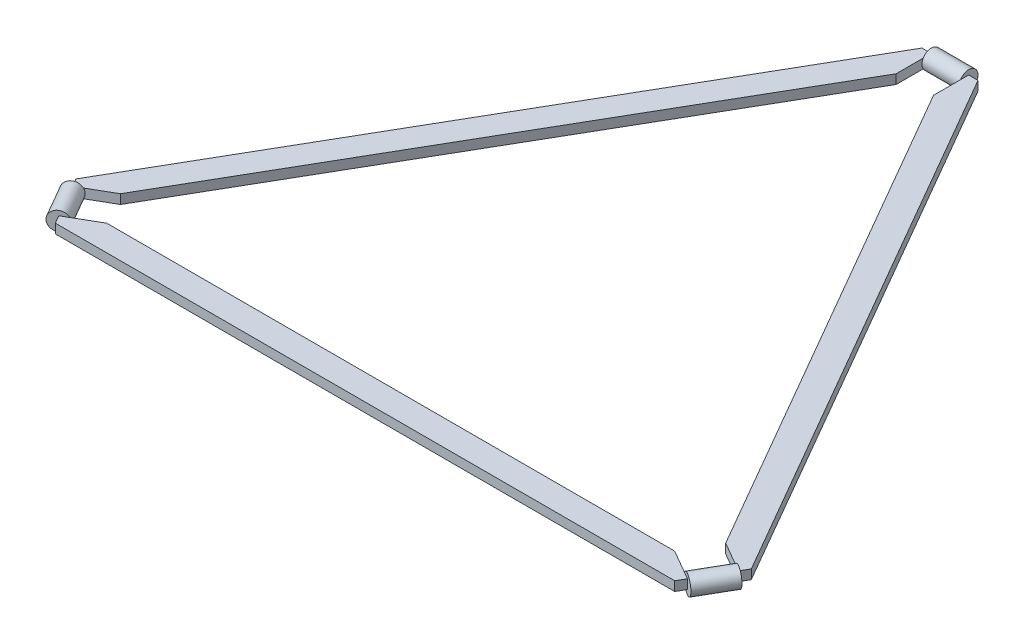
ISO-10303-21;
HEADER;
FILE_DESCRIPTION(('STEP AP214'),'2;1');
FILE_NAME('part.step','',(''),(''),'','','');
FILE_SCHEMA(('AUTOMOTIVE_DESIGN { 1 0 10303 214 1 1 1 1 }'));
ENDSEC;
DATA;
#1=APPLICATION_CONTEXT('core data for automotive mechanical design processes');
#2=APPLICATION_PROTOCOL_DEFINITION('international standard','automotive_design',2000,#1);
#3=PRODUCT_CONTEXT('',#1,'mechanical');
#4=PRODUCT('Part','Part','',(#3));
#5=PRODUCT_RELATED_PRODUCT_CATEGORY('part','',(#4));
#6=PRODUCT_DEFINITION_FORMATION('','',#4);
#7=PRODUCT_DEFINITION_CONTEXT('part definition',#1,'design');
#8=PRODUCT_DEFINITION('design','',#6,#7);
#9=PRODUCT_DEFINITION_SHAPE('','',#8);
#10=(LENGTH_UNIT() NAMED_UNIT(*) SI_UNIT(.MILLI.,.METRE.));
#11=(NAMED_UNIT(*) PLANE_ANGLE_UNIT() SI_UNIT($,.RADIAN.));
#12=(NAMED_UNIT(*) SI_UNIT($,.STERADIAN.) SOLID_ANGLE_UNIT());
#13=UNCERTAINTY_MEASURE_WITH_UNIT(LENGTH_MEASURE(1.E-05),#10,'distance_accuracy_value','');
#14=(GEOMETRIC_REPRESENTATION_CONTEXT(3) GLOBAL_UNCERTAINTY_ASSIGNED_CONTEXT((#13)) GLOBAL_UNIT_ASSIGNED_CONTEXT((#10,
#11,#12)) REPRESENTATION_CONTEXT('',''));
#15=CARTESIAN_POINT('',(0.,0.,0.));
#16=DIRECTION('',(0.,0.,1.));
#17=DIRECTION('',(1.,0.,0.));
#18=AXIS2_PLACEMENT_3D('',#15,#16,#17);
#19=CARTESIAN_POINT('',(-356.410161513775,0.,182.679491924312));
#20=DIRECTION('',(0.5,0.,0.866025403784438));
#21=DIRECTION('',(0.866025403784439,0.,-0.5));
#22=AXIS2_PLACEMENT_3D('',#19,#20,#21);
#23=PLANE('',#22);
#24=DIRECTION('',(-0.866025403784438,0.,0.5));
#25=VECTOR('',#24,1.);
#26=CARTESIAN_POINT('',(-9.99999999999995,-5.,-17.3205080756887));
#27=LINE('',#26,#25);
#28=CARTESIAN_POINT('',(-348.910161513775,-5.,178.349364905389));
#29=VERTEX_POINT('',#28);
#30=CARTESIAN_POINT('',(-356.410161513775,-5.,182.679491924311));
#31=VERTEX_POINT('',#30);
#32=EDGE_CURVE('E53',#29,#31,#27,.T.);
#33=ORIENTED_EDGE('',*,*,#32,.F.);
#34=CARTESIAN_POINT('',(-356.410161513775,0.,182.679491924312));
#35=DIRECTION('',(0.5,0.,0.866025403784438));
#36=DIRECTION('',(0.866025403784439,0.,-0.5));
#37=AXIS2_PLACEMENT_3D('',#34,#35,#36);
#38=CIRCLE('',#37,9.99999999999998);
#39=CARTESIAN_POINT('',(-348.910161513775,5.,178.349364905389));
#40=VERTEX_POINT('',#39);
#41=EDGE_CURVE('E377',#40,#29,#38,.T.);
#42=ORIENTED_EDGE('',*,*,#41,.F.);
#43=DIRECTION('',(-0.866025403784438,0.,0.5));
#44=VECTOR('',#43,1.);
#45=CARTESIAN_POINT('',(-9.99999999999995,5.,-17.3205080756887));
#46=LINE('',#45,#44);
#47=CARTESIAN_POINT('',(-356.410161513775,5.,182.679491924311));
#48=VERTEX_POINT('',#47);
#49=EDGE_CURVE('E316',#40,#48,#46,.T.);
#50=ORIENTED_EDGE('',*,*,#49,.T.);
#51=DIRECTION('',(0.,-1.,0.));
#52=VECTOR('',#51,1.);
#53=CARTESIAN_POINT('',(-356.410161513775,5.,182.679491924311));
#54=LINE('',#53,#52);
#55=EDGE_CURVE('E336',#48,#31,#54,.T.);
#56=ORIENTED_EDGE('',*,*,#55,.T.);
#57=EDGE_LOOP('',(#33,#42,#50,#56));
#58=FACE_BOUND('',#57,.T.);
#59=ADVANCED_FACE('F43',(#58),#23,.F.);
#60=CARTESIAN_POINT('',(-9.99999999999993,5.,17.3205080756886));
#61=DIRECTION('',(0.5,0.,-0.866025403784439));
#62=DIRECTION('',(-0.866025403784439,0.,-0.5));
#63=AXIS2_PLACEMENT_3D('',#60,#61,#62);
#64=PLANE('',#63);
#65=CARTESIAN_POINT('',(336.410161513776,0.,217.320508075689));
#66=DIRECTION('',(0.5,0.,-0.866025403784439));
#67=DIRECTION('',(-0.866025403784439,0.,-0.5));
#68=AXIS2_PLACEMENT_3D('',#65,#66,#67);
#69=CIRCLE('',#68,9.99999999999999);
#70=CARTESIAN_POINT('',(328.910161513776,-5.,212.990381056767));
#71=VERTEX_POINT('',#70);
#72=CARTESIAN_POINT('',(328.910161513776,4.99999999999999,212.990381056767));
#73=VERTEX_POINT('',#72);
#74=EDGE_CURVE('E11',#71,#73,#69,.T.);
#75=ORIENTED_EDGE('',*,*,#74,.F.);
#76=DIRECTION('',(0.866025403784439,0.,0.5));
#77=VECTOR('',#76,1.);
#78=CARTESIAN_POINT('',(-9.99999999999993,-5.,17.3205080756886));
#79=LINE('',#78,#77);
#80=CARTESIAN_POINT('',(303.846502664651,-5.,198.519870873347));
#81=VERTEX_POINT('',#80);
#82=EDGE_CURVE('E414',#81,#71,#79,.T.);
#83=ORIENTED_EDGE('',*,*,#82,.F.);
#84=DIRECTION('',(0.,-1.,0.));
#85=VECTOR('',#84,1.);
#86=CARTESIAN_POINT('',(303.846502664651,5.,198.519870873347));
#87=LINE('',#86,#85);
#88=CARTESIAN_POINT('',(303.846502664651,5.,198.519870873347));
#89=VERTEX_POINT('',#88);
#90=EDGE_CURVE('E47',#89,#81,#87,.T.);
#91=ORIENTED_EDGE('',*,*,#90,.F.);
#92=DIRECTION('',(0.866025403784439,0.,0.5));
#93=VECTOR('',#92,1.);
#94=CARTESIAN_POINT('',(-9.99999999999993,5.,17.3205080756886));
#95=LINE('',#94,#93);
#96=EDGE_CURVE('E388',#89,#73,#95,.T.);
#97=ORIENTED_EDGE('',*,*,#96,.T.);
#98=EDGE_LOOP('',(#75,#83,#91,#97));
#99=FACE_BOUND('',#98,.T.);
#100=ADVANCED_FACE('F45',(#99),#64,.T.);
#101=CARTESIAN_POINT('',(0.,5.,198.519870873347));
#102=DIRECTION('',(0.,0.,-1.));
#103=DIRECTION('',(-1.,0.,0.));
#104=AXIS2_PLACEMENT_3D('',#101,#102,#103);
#105=PLANE('',#104);
#106=DIRECTION('',(1.,0.,0.));
#107=VECTOR('',#106,1.);
#108=CARTESIAN_POINT('',(0.,-5.,198.519870873347));
#109=LINE('',#108,#107);
#110=CARTESIAN_POINT('',(-303.84650266465,-5.,198.519870873348));
#111=VERTEX_POINT('',#110);
#112=EDGE_CURVE('E417',#111,#81,#109,.T.);
#113=ORIENTED_EDGE('',*,*,#112,.F.);
#114=DIRECTION('',(0.,-1.,0.));
#115=VECTOR('',#114,1.);
#116=CARTESIAN_POINT('',(-303.84650266465,5.,198.519870873348));
#117=LINE('',#116,#115);
#118=CARTESIAN_POINT('',(-303.84650266465,5.,198.519870873348));
#119=VERTEX_POINT('',#118);
#120=EDGE_CURVE('E448',#119,#111,#117,.T.);
#121=ORIENTED_EDGE('',*,*,#120,.F.);
#122=DIRECTION('',(1.,0.,0.));
#123=VECTOR('',#122,1.);
#124=CARTESIAN_POINT('',(0.,5.,198.519870873347));
#125=LINE('',#124,#123);
#126=EDGE_CURVE('E391',#119,#89,#125,.T.);
#127=ORIENTED_EDGE('',*,*,#126,.T.);
#128=ORIENTED_EDGE('',*,*,#90,.T.);
#129=EDGE_LOOP('',(#113,#121,#127,#128));
#130=FACE_BOUND('',#129,.T.);
#131=ADVANCED_FACE('F525',(#130),#105,.T.);
#132=CARTESIAN_POINT('',(10.0000000000002,5.,17.3205080756892));
#133=DIRECTION('',(-0.5,0.,-0.866025403784439));
#134=DIRECTION('',(-0.866025403784439,0.,0.5));
#135=AXIS2_PLACEMENT_3D('',#132,#133,#134);
#136=PLANE('',#135);
#137=CARTESIAN_POINT('',(-336.410161513775,0.,217.320508075689));
#138=DIRECTION('',(-0.5,0.,-0.866025403784439));
#139=DIRECTION('',(-0.866025403784439,0.,0.5));
#140=AXIS2_PLACEMENT_3D('',#137,#138,#139);
#141=CIRCLE('',#140,9.99999999999998);
#142=CARTESIAN_POINT('',(-328.910161513775,5.,212.990381056767));
#143=VERTEX_POINT('',#142);
#144=CARTESIAN_POINT('',(-328.910161513775,-4.99999999999999,212.990381056767));
#145=VERTEX_POINT('',#144);
#146=EDGE_CURVE('E383',#143,#145,#141,.T.);
#147=ORIENTED_EDGE('',*,*,#146,.F.);
#148=DIRECTION('',(0.866025403784439,0.,-0.5));
#149=VECTOR('',#148,1.);
#150=CARTESIAN_POINT('',(10.0000000000002,5.,17.3205080756892));
#151=LINE('',#150,#149);
#152=EDGE_CURVE('E396',#143,#119,#151,.T.);
#153=ORIENTED_EDGE('',*,*,#152,.T.);
#154=ORIENTED_EDGE('',*,*,#120,.T.);
#155=DIRECTION('',(0.866025403784439,0.,-0.5));
#156=VECTOR('',#155,1.);
#157=CARTESIAN_POINT('',(10.0000000000002,-5.,17.3205080756892));
#158=LINE('',#157,#156);
#159=EDGE_CURVE('E421',#145,#111,#158,.T.);
#160=ORIENTED_EDGE('',*,*,#159,.F.);
#161=EDGE_LOOP('',(#147,#153,#154,#160));
#162=FACE_BOUND('',#161,.T.);
#163=ADVANCED_FACE('F551',(#162),#136,.T.);
#164=CARTESIAN_POINT('',(-346.410161513775,5.,200.));
#165=DIRECTION('',(-0.866025403784438,0.,0.500000000000001));
#166=DIRECTION('',(0.500000000000001,0.,0.866025403784438));
#167=AXIS2_PLACEMENT_3D('',#164,#165,#166);
#168=PLANE('',#167);
#169=DIRECTION('',(-0.500000000000001,0.,-0.866025403784438));
#170=VECTOR('',#169,1.);
#171=CARTESIAN_POINT('',(-346.410161513775,-5.,200.));
#172=LINE('',#171,#170);
#173=CARTESIAN_POINT('',(-331.410161513775,-5.,225.980762113533));
#174=VERTEX_POINT('',#173);
#175=CARTESIAN_POINT('',(-336.410161513775,-5.,217.320508075689));
#176=VERTEX_POINT('',#175);
#177=EDGE_CURVE('E425',#174,#176,#172,.T.);
#178=ORIENTED_EDGE('',*,*,#177,.F.);
#179=DIRECTION('',(0.,-1.,0.));
#180=VECTOR('',#179,1.);
#181=CARTESIAN_POINT('',(-331.410161513775,5.,225.980762113533));
#182=LINE('',#181,#180);
#183=CARTESIAN_POINT('',(-331.410161513775,5.,225.980762113533));
#184=VERTEX_POINT('',#183);
#185=EDGE_CURVE('E443',#184,#174,#182,.T.);
#186=ORIENTED_EDGE('',*,*,#185,.F.);
#187=DIRECTION('',(-0.500000000000001,0.,-0.866025403784438));
#188=VECTOR('',#187,1.);
#189=CARTESIAN_POINT('',(-346.410161513775,5.,200.));
#190=LINE('',#189,#188);
#191=CARTESIAN_POINT('',(-336.410161513775,5.,217.320508075689));
#192=VERTEX_POINT('',#191);
#193=EDGE_CURVE('E401',#184,#192,#190,.T.);
#194=ORIENTED_EDGE('',*,*,#193,.T.);
#195=DIRECTION('',(0.,-1.,0.));
#196=VECTOR('',#195,1.);
#197=CARTESIAN_POINT('',(-336.410161513775,5.,217.320508075689));
#198=LINE('',#197,#196);
#199=EDGE_CURVE('E446',#192,#176,#198,.T.);
#200=ORIENTED_EDGE('',*,*,#199,.T.);
#201=EDGE_LOOP('',(#178,#186,#194,#200));
#202=FACE_BOUND('',#201,.T.);
#203=ADVANCED_FACE('F547',(#202),#168,.T.);
#204=CARTESIAN_POINT('',(0.,5.,225.980762113533));
#205=DIRECTION('',(0.,0.,1.));
#206=DIRECTION('',(1.,0.,0.));
#207=AXIS2_PLACEMENT_3D('',#204,#205,#206);
#208=PLANE('',#207);
#209=DIRECTION('',(-1.,0.,0.));
#210=VECTOR('',#209,1.);
#211=CARTESIAN_POINT('',(0.,-5.,225.980762113533));
#212=LINE('',#211,#210);
#213=CARTESIAN_POINT('',(331.410161513776,-5.,225.980762113533));
#214=VERTEX_POINT('',#213);
#215=EDGE_CURVE('E429',#214,#174,#212,.T.);
#216=ORIENTED_EDGE('',*,*,#215,.F.);
#217=DIRECTION('',(0.,-1.,0.));
#218=VECTOR('',#217,1.);
#219=CARTESIAN_POINT('',(331.410161513776,5.,225.980762113533));
#220=LINE('',#219,#218);
#221=CARTESIAN_POINT('',(331.410161513776,5.,225.980762113533));
#222=VERTEX_POINT('',#221);
#223=EDGE_CURVE('E440',#222,#214,#220,.T.);
#224=ORIENTED_EDGE('',*,*,#223,.F.);
#225=DIRECTION('',(-1.,0.,0.));
#226=VECTOR('',#225,1.);
#227=CARTESIAN_POINT('',(0.,5.,225.980762113533));
#228=LINE('',#227,#226);
#229=EDGE_CURVE('E405',#222,#184,#228,.T.);
#230=ORIENTED_EDGE('',*,*,#229,.T.);
#231=ORIENTED_EDGE('',*,*,#185,.T.);
#232=EDGE_LOOP('',(#216,#224,#230,#231));
#233=FACE_BOUND('',#232,.T.);
#234=ADVANCED_FACE('F543',(#233),#208,.T.);
#235=CARTESIAN_POINT('',(346.410161513776,5.,200.));
#236=DIRECTION('',(0.866025403784439,0.,0.499999999999999));
#237=DIRECTION('',(0.499999999999999,0.,-0.866025403784439));
#238=AXIS2_PLACEMENT_3D('',#235,#236,#237);
#239=PLANE('',#238);
#240=DIRECTION('',(-0.499999999999999,0.,0.866025403784439));
#241=VECTOR('',#240,1.);
#242=CARTESIAN_POINT('',(346.410161513776,-5.,200.));
#243=LINE('',#242,#241);
#244=CARTESIAN_POINT('',(336.410161513776,-5.,217.320508075689));
#245=VERTEX_POINT('',#244);
#246=EDGE_CURVE('E433',#245,#214,#243,.T.);
#247=ORIENTED_EDGE('',*,*,#246,.F.);
#248=DIRECTION('',(0.,-1.,0.));
#249=VECTOR('',#248,1.);
#250=CARTESIAN_POINT('',(336.410161513776,5.,217.320508075689));
#251=LINE('',#250,#249);
#252=CARTESIAN_POINT('',(336.410161513776,5.,217.320508075689));
#253=VERTEX_POINT('',#252);
#254=EDGE_CURVE('E413',#253,#245,#251,.T.);
#255=ORIENTED_EDGE('',*,*,#254,.F.);
#256=DIRECTION('',(-0.499999999999999,0.,0.866025403784439));
#257=VECTOR('',#256,1.);
#258=CARTESIAN_POINT('',(346.410161513776,5.,200.));
#259=LINE('',#258,#257);
#260=EDGE_CURVE('E409',#253,#222,#259,.T.);
#261=ORIENTED_EDGE('',*,*,#260,.T.);
#262=ORIENTED_EDGE('',*,*,#223,.T.);
#263=EDGE_LOOP('',(#247,#255,#261,#262));
#264=FACE_BOUND('',#263,.T.);
#265=ADVANCED_FACE('F537',(#264),#239,.T.);
#266=CARTESIAN_POINT('',(0.,5.,0.));
#267=DIRECTION('',(0.,1.,0.));
#268=DIRECTION('',(0.,0.,1.));
#269=AXIS2_PLACEMENT_3D('',#266,#267,#268);
#270=PLANE('',#269);
#271=ORIENTED_EDGE('',*,*,#96,.F.);
#272=ORIENTED_EDGE('',*,*,#126,.F.);
#273=ORIENTED_EDGE('',*,*,#152,.F.);
#274=EDGE_CURVE('E397',#192,#143,#151,.T.);
#275=ORIENTED_EDGE('',*,*,#274,.F.);
#276=ORIENTED_EDGE('',*,*,#193,.F.);
#277=ORIENTED_EDGE('',*,*,#229,.F.);
#278=ORIENTED_EDGE('',*,*,#260,.F.);
#279=EDGE_CURVE('E392',#73,#253,#95,.T.);
#280=ORIENTED_EDGE('',*,*,#279,.F.);
#281=EDGE_LOOP('',(#271,#272,#273,#275,#276,#277,#278,#280));
#282=FACE_BOUND('',#281,.T.);
#283=ADVANCED_FACE('F507',(#282),#270,.T.);
#284=CARTESIAN_POINT('',(0.,-5.,0.));
#285=DIRECTION('',(0.,1.,0.));
#286=DIRECTION('',(0.,0.,1.));
#287=AXIS2_PLACEMENT_3D('',#284,#285,#286);
#288=PLANE('',#287);
#289=ORIENTED_EDGE('',*,*,#82,.T.);
#290=EDGE_CURVE('E387',#71,#245,#79,.T.);
#291=ORIENTED_EDGE('',*,*,#290,.T.);
#292=ORIENTED_EDGE('',*,*,#246,.T.);
#293=ORIENTED_EDGE('',*,*,#215,.T.);
#294=ORIENTED_EDGE('',*,*,#177,.T.);
#295=EDGE_CURVE('E422',#176,#145,#158,.T.);
#296=ORIENTED_EDGE('',*,*,#295,.T.);
#297=ORIENTED_EDGE('',*,*,#159,.T.);
#298=ORIENTED_EDGE('',*,*,#112,.T.);
#299=EDGE_LOOP('',(#289,#291,#292,#293,#294,#296,#297,#298));
#300=FACE_BOUND('',#299,.T.);
#301=ADVANCED_FACE('F533',(#300),#288,.F.);
#302=CARTESIAN_POINT('',(-322.268025890044,0.,241.815405503521));
#303=DIRECTION('',(-0.5,0.,-0.866025403784438));
#304=DIRECTION('',(-0.866025403784439,0.,0.5));
#305=AXIS2_PLACEMENT_3D('',#302,#303,#304);
#306=CYLINDRICAL_SURFACE('',#305,9.99999999999998);
#307=ORIENTED_EDGE('',*,*,#146,.T.);
#308=EDGE_CURVE('E381',#145,#143,#141,.T.);
#309=ORIENTED_EDGE('',*,*,#308,.T.);
#310=EDGE_LOOP('',(#307,#309));
#311=FACE_BOUND('',#310,.T.);
#312=ORIENTED_EDGE('',*,*,#41,.T.);
#313=EDGE_CURVE('E382',#29,#40,#38,.T.);
#314=ORIENTED_EDGE('',*,*,#313,.T.);
#315=EDGE_LOOP('',(#312,#314));
#316=FACE_BOUND('',#315,.T.);
#317=ADVANCED_FACE('F530',(#311,#316),#306,.T.);
#318=CARTESIAN_POINT('',(10.0000000000002,5.,17.3205080756892));
#319=DIRECTION('',(-0.5,0.,-0.866025403784439));
#320=DIRECTION('',(-0.866025403784439,0.,0.5));
#321=AXIS2_PLACEMENT_3D('',#318,#319,#320);
#322=PLANE('',#321);
#323=ORIENTED_EDGE('',*,*,#295,.F.);
#324=ORIENTED_EDGE('',*,*,#199,.F.);
#325=ORIENTED_EDGE('',*,*,#274,.T.);
#326=ORIENTED_EDGE('',*,*,#308,.F.);
#327=EDGE_LOOP('',(#323,#324,#325,#326));
#328=FACE_BOUND('',#327,.T.);
#329=ADVANCED_FACE('F528',(#328),#322,.F.);
#330=CARTESIAN_POINT('',(-9.99999999999995,5.,-17.3205080756887));
#331=DIRECTION('',(0.5,0.,0.866025403784438));
#332=DIRECTION('',(0.866025403784438,0.,-0.5));
#333=AXIS2_PLACEMENT_3D('',#330,#331,#332);
#334=PLANE('',#333);
#335=ORIENTED_EDGE('',*,*,#313,.F.);
#336=CARTESIAN_POINT('',(-323.84650266465,-5.,163.87885472197));
#337=VERTEX_POINT('',#336);
#338=EDGE_CURVE('E309',#337,#29,#27,.T.);
#339=ORIENTED_EDGE('',*,*,#338,.F.);
#340=DIRECTION('',(0.,-1.,0.));
#341=VECTOR('',#340,1.);
#342=CARTESIAN_POINT('',(-323.84650266465,5.,163.87885472197));
#343=LINE('',#342,#341);
#344=CARTESIAN_POINT('',(-323.84650266465,5.,163.87885472197));
#345=VERTEX_POINT('',#344);
#346=EDGE_CURVE('E374',#345,#337,#343,.T.);
#347=ORIENTED_EDGE('',*,*,#346,.F.);
#348=EDGE_CURVE('E310',#345,#40,#46,.T.);
#349=ORIENTED_EDGE('',*,*,#348,.T.);
#350=EDGE_LOOP('',(#335,#339,#347,#349));
#351=FACE_BOUND('',#350,.T.);
#352=ADVANCED_FACE('F594',(#351),#334,.T.);
#353=CARTESIAN_POINT('',(20.0000000000001,5.,0.));
#354=DIRECTION('',(-1.,0.,0.));
#355=DIRECTION('',(0.,0.,1.));
#356=AXIS2_PLACEMENT_3D('',#353,#354,#355);
#357=PLANE('',#356);
#358=DIRECTION('',(0.,0.,-1.));
#359=VECTOR('',#358,1.);
#360=CARTESIAN_POINT('',(20.0000000000001,-5.,0.));
#361=LINE('',#360,#359);
#362=CARTESIAN_POINT('',(20.,-5.,-391.339745962156));
#363=VERTEX_POINT('',#362);
#364=CARTESIAN_POINT('',(20.,-5.,-400.));
#365=VERTEX_POINT('',#364);
#366=EDGE_CURVE('E270',#363,#365,#361,.T.);
#367=ORIENTED_EDGE('',*,*,#366,.F.);
#368=CARTESIAN_POINT('',(20.,0.,-400.));
#369=DIRECTION('',(-1.,0.,0.));
#370=DIRECTION('',(0.,0.,1.));
#371=AXIS2_PLACEMENT_3D('',#368,#369,#370);
#372=CIRCLE('',#371,9.99999999999998);
#373=CARTESIAN_POINT('',(20.,5.,-391.339745962156));
#374=VERTEX_POINT('',#373);
#375=EDGE_CURVE('E305',#374,#363,#372,.T.);
#376=ORIENTED_EDGE('',*,*,#375,.F.);
#377=DIRECTION('',(0.,0.,-1.));
#378=VECTOR('',#377,1.);
#379=CARTESIAN_POINT('',(20.0000000000001,5.,0.));
#380=LINE('',#379,#378);
#381=CARTESIAN_POINT('',(20.,5.,-400.));
#382=VERTEX_POINT('',#381);
#383=EDGE_CURVE('E250',#374,#382,#380,.T.);
#384=ORIENTED_EDGE('',*,*,#383,.T.);
#385=DIRECTION('',(0.,-1.,0.));
#386=VECTOR('',#385,1.);
#387=CARTESIAN_POINT('',(20.,5.,-400.));
#388=LINE('',#387,#386);
#389=EDGE_CURVE('E267',#382,#365,#388,.T.);
#390=ORIENTED_EDGE('',*,*,#389,.T.);
#391=EDGE_LOOP('',(#367,#376,#384,#390));
#392=FACE_BOUND('',#391,.T.);
#393=ADVANCED_FACE('F592',(#392),#357,.F.);
#394=CARTESIAN_POINT('',(-171.923251332325,5.,-99.2599354366735));
#395=DIRECTION('',(0.866025403784439,0.,0.5));
#396=DIRECTION('',(0.5,0.,-0.866025403784439));
#397=AXIS2_PLACEMENT_3D('',#394,#395,#396);
#398=PLANE('',#397);
#399=DIRECTION('',(-0.5,0.,0.866025403784439));
#400=VECTOR('',#399,1.);
#401=CARTESIAN_POINT('',(-171.923251332325,-5.,-99.2599354366735));
#402=LINE('',#401,#400);
#403=CARTESIAN_POINT('',(-20.,-5.,-362.398725595316));
#404=VERTEX_POINT('',#403);
#405=EDGE_CURVE('E340',#404,#337,#402,.T.);
#406=ORIENTED_EDGE('',*,*,#405,.F.);
#407=DIRECTION('',(0.,-1.,0.));
#408=VECTOR('',#407,1.);
#409=CARTESIAN_POINT('',(-20.,5.,-362.398725595316));
#410=LINE('',#409,#408);
#411=CARTESIAN_POINT('',(-20.,5.,-362.398725595316));
#412=VERTEX_POINT('',#411);
#413=EDGE_CURVE('E370',#412,#404,#410,.T.);
#414=ORIENTED_EDGE('',*,*,#413,.F.);
#415=DIRECTION('',(-0.5,0.,0.866025403784439));
#416=VECTOR('',#415,1.);
#417=CARTESIAN_POINT('',(-171.923251332325,5.,-99.2599354366735));
#418=LINE('',#417,#416);
#419=EDGE_CURVE('E314',#412,#345,#418,.T.);
#420=ORIENTED_EDGE('',*,*,#419,.T.);
#421=ORIENTED_EDGE('',*,*,#346,.T.);
#422=EDGE_LOOP('',(#406,#414,#420,#421));
#423=FACE_BOUND('',#422,.T.);
#424=ADVANCED_FACE('F590',(#423),#398,.T.);
#425=CARTESIAN_POINT('',(-20.,5.,0.));
#426=DIRECTION('',(1.,0.,0.));
#427=DIRECTION('',(0.,0.,-1.));
#428=AXIS2_PLACEMENT_3D('',#425,#426,#427);
#429=PLANE('',#428);
#430=CARTESIAN_POINT('',(-20.,0.,-400.));
#431=DIRECTION('',(1.,0.,0.));
#432=DIRECTION('',(0.,0.,-1.));
#433=AXIS2_PLACEMENT_3D('',#430,#431,#432);
#434=CIRCLE('',#433,9.99999999999998);
#435=CARTESIAN_POINT('',(-20.,5.,-391.339745962156));
#436=VERTEX_POINT('',#435);
#437=CARTESIAN_POINT('',(-20.,-4.99999999999999,-391.339745962156));
#438=VERTEX_POINT('',#437);
#439=EDGE_CURVE('E300',#436,#438,#434,.T.);
#440=ORIENTED_EDGE('',*,*,#439,.F.);
#441=DIRECTION('',(0.,0.,1.));
#442=VECTOR('',#441,1.);
#443=CARTESIAN_POINT('',(-20.,5.,0.));
#444=LINE('',#443,#442);
#445=EDGE_CURVE('E320',#436,#412,#444,.T.);
#446=ORIENTED_EDGE('',*,*,#445,.T.);
#447=ORIENTED_EDGE('',*,*,#413,.T.);
#448=DIRECTION('',(0.,0.,1.));
#449=VECTOR('',#448,1.);
#450=CARTESIAN_POINT('',(-20.,-5.,0.));
#451=LINE('',#450,#449);
#452=EDGE_CURVE('E344',#438,#404,#451,.T.);
#453=ORIENTED_EDGE('',*,*,#452,.F.);
#454=EDGE_LOOP('',(#440,#446,#447,#453));
#455=FACE_BOUND('',#454,.T.);
#456=ADVANCED_FACE('F493',(#455),#429,.T.);
#457=CARTESIAN_POINT('',(0.,5.,-400.));
#458=DIRECTION('',(0.,0.,-1.));
#459=DIRECTION('',(-1.,0.,0.));
#460=AXIS2_PLACEMENT_3D('',#457,#458,#459);
#461=PLANE('',#460);
#462=DIRECTION('',(1.,0.,0.));
#463=VECTOR('',#462,1.);
#464=CARTESIAN_POINT('',(0.,-5.,-400.));
#465=LINE('',#464,#463);
#466=CARTESIAN_POINT('',(-30.,-5.,-400.));
#467=VERTEX_POINT('',#466);
#468=CARTESIAN_POINT('',(-20.,-5.,-400.));
#469=VERTEX_POINT('',#468);
#470=EDGE_CURVE('E348',#467,#469,#465,.T.);
#471=ORIENTED_EDGE('',*,*,#470,.F.);
#472=DIRECTION('',(0.,-1.,0.));
#473=VECTOR('',#472,1.);
#474=CARTESIAN_POINT('',(-30.,5.,-400.));
#475=LINE('',#474,#473);
#476=CARTESIAN_POINT('',(-30.,5.,-400.));
#477=VERTEX_POINT('',#476);
#478=EDGE_CURVE('E365',#477,#467,#475,.T.);
#479=ORIENTED_EDGE('',*,*,#478,.F.);
#480=DIRECTION('',(1.,0.,0.));
#481=VECTOR('',#480,1.);
#482=CARTESIAN_POINT('',(0.,5.,-400.));
#483=LINE('',#482,#481);
#484=CARTESIAN_POINT('',(-20.,5.,-400.));
#485=VERTEX_POINT('',#484);
#486=EDGE_CURVE('E325',#477,#485,#483,.T.);
#487=ORIENTED_EDGE('',*,*,#486,.T.);
#488=DIRECTION('',(0.,-1.,0.));
#489=VECTOR('',#488,1.);
#490=CARTESIAN_POINT('',(-20.,5.,-400.));
#491=LINE('',#490,#489);
#492=EDGE_CURVE('E368',#485,#469,#491,.T.);
#493=ORIENTED_EDGE('',*,*,#492,.T.);
#494=EDGE_LOOP('',(#471,#479,#487,#493));
#495=FACE_BOUND('',#494,.T.);
#496=ADVANCED_FACE('F485',(#495),#461,.T.);
#497=CARTESIAN_POINT('',(-195.705080756888,5.,-112.990381056766));
#498=DIRECTION('',(0.866025403784439,0.,0.5));
#499=DIRECTION('',(0.5,0.,-0.866025403784439));
#500=AXIS2_PLACEMENT_3D('',#497,#498,#499);
#501=PLANE('',#500);
#502=DIRECTION('',(-0.5,0.,0.866025403784439));
#503=VECTOR('',#502,1.);
#504=CARTESIAN_POINT('',(-195.705080756888,-5.,-112.990381056766));
#505=LINE('',#504,#503);
#506=CARTESIAN_POINT('',(-361.410161513775,-5.,174.019237886467));
#507=VERTEX_POINT('',#506);
#508=EDGE_CURVE('E352',#467,#507,#505,.T.);
#509=ORIENTED_EDGE('',*,*,#508,.T.);
#510=DIRECTION('',(0.,-1.,0.));
#511=VECTOR('',#510,1.);
#512=CARTESIAN_POINT('',(-361.410161513775,5.,174.019237886467));
#513=LINE('',#512,#511);
#514=CARTESIAN_POINT('',(-361.410161513775,5.,174.019237886467));
#515=VERTEX_POINT('',#514);
#516=EDGE_CURVE('E362',#515,#507,#513,.T.);
#517=ORIENTED_EDGE('',*,*,#516,.F.);
#518=DIRECTION('',(-0.5,0.,0.866025403784439));
#519=VECTOR('',#518,1.);
#520=CARTESIAN_POINT('',(-195.705080756888,5.,-112.990381056766));
#521=LINE('',#520,#519);
#522=EDGE_CURVE('E329',#477,#515,#521,.T.);
#523=ORIENTED_EDGE('',*,*,#522,.F.);
#524=ORIENTED_EDGE('',*,*,#478,.T.);
#525=EDGE_LOOP('',(#509,#517,#523,#524));
#526=FACE_BOUND('',#525,.T.);
#527=ADVANCED_FACE('F481',(#526),#501,.F.);
#528=CARTESIAN_POINT('',(-346.410161513775,5.,200.));
#529=DIRECTION('',(-0.866025403784438,0.,0.500000000000001));
#530=DIRECTION('',(0.500000000000001,0.,0.866025403784438));
#531=AXIS2_PLACEMENT_3D('',#528,#529,#530);
#532=PLANE('',#531);
#533=DIRECTION('',(-0.500000000000001,0.,-0.866025403784438));
#534=VECTOR('',#533,1.);
#535=CARTESIAN_POINT('',(-346.410161513775,-5.,200.));
#536=LINE('',#535,#534);
#537=EDGE_CURVE('E315',#31,#507,#536,.T.);
#538=ORIENTED_EDGE('',*,*,#537,.F.);
#539=ORIENTED_EDGE('',*,*,#55,.F.);
#540=DIRECTION('',(-0.500000000000001,0.,-0.866025403784438));
#541=VECTOR('',#540,1.);
#542=CARTESIAN_POINT('',(-346.410161513775,5.,200.));
#543=LINE('',#542,#541);
#544=EDGE_CURVE('E332',#48,#515,#543,.T.);
#545=ORIENTED_EDGE('',*,*,#544,.T.);
#546=ORIENTED_EDGE('',*,*,#516,.T.);
#547=EDGE_LOOP('',(#538,#539,#545,#546));
#548=FACE_BOUND('',#547,.T.);
#549=ADVANCED_FACE('F473',(#548),#532,.T.);
#550=CARTESIAN_POINT('',(0.,5.,0.));
#551=DIRECTION('',(0.,1.,0.));
#552=DIRECTION('',(0.,0.,1.));
#553=AXIS2_PLACEMENT_3D('',#550,#551,#552);
#554=PLANE('',#553);
#555=ORIENTED_EDGE('',*,*,#348,.F.);
#556=ORIENTED_EDGE('',*,*,#419,.F.);
#557=ORIENTED_EDGE('',*,*,#445,.F.);
#558=EDGE_CURVE('E321',#485,#436,#444,.T.);
#559=ORIENTED_EDGE('',*,*,#558,.F.);
#560=ORIENTED_EDGE('',*,*,#486,.F.);
#561=ORIENTED_EDGE('',*,*,#522,.T.);
#562=ORIENTED_EDGE('',*,*,#544,.F.);
#563=ORIENTED_EDGE('',*,*,#49,.F.);
#564=EDGE_LOOP('',(#555,#556,#557,#559,#560,#561,#562,#563));
#565=FACE_BOUND('',#564,.T.);
#566=ADVANCED_FACE('F476',(#565),#554,.T.);
#567=CARTESIAN_POINT('',(0.,-5.,0.));
#568=DIRECTION('',(0.,1.,0.));
#569=DIRECTION('',(0.,0.,1.));
#570=AXIS2_PLACEMENT_3D('',#567,#568,#569);
#571=PLANE('',#570);
#572=ORIENTED_EDGE('',*,*,#338,.T.);
#573=ORIENTED_EDGE('',*,*,#32,.T.);
#574=ORIENTED_EDGE('',*,*,#537,.T.);
#575=ORIENTED_EDGE('',*,*,#508,.F.);
#576=ORIENTED_EDGE('',*,*,#470,.T.);
#577=EDGE_CURVE('E345',#469,#438,#451,.T.);
#578=ORIENTED_EDGE('',*,*,#577,.T.);
#579=ORIENTED_EDGE('',*,*,#452,.T.);
#580=ORIENTED_EDGE('',*,*,#405,.T.);
#581=EDGE_LOOP('',(#572,#573,#574,#575,#576,#578,#579,#580));
#582=FACE_BOUND('',#581,.T.);
#583=ADVANCED_FACE('F468',(#582),#571,.F.);
#584=CARTESIAN_POINT('',(-20.,0.,-400.));
#585=DIRECTION('',(1.,0.,0.));
#586=DIRECTION('',(0.,0.,-1.));
#587=AXIS2_PLACEMENT_3D('',#584,#585,#586);
#588=PLANE('',#587);
#589=ORIENTED_EDGE('',*,*,#577,.F.);
#590=ORIENTED_EDGE('',*,*,#492,.F.);
#591=ORIENTED_EDGE('',*,*,#558,.T.);
#592=EDGE_CURVE('E299',#438,#436,#434,.T.);
#593=ORIENTED_EDGE('',*,*,#592,.F.);
#594=EDGE_LOOP('',(#589,#590,#591,#593));
#595=FACE_BOUND('',#594,.T.);
#596=ADVANCED_FACE('F488',(#595),#588,.F.);
#597=CARTESIAN_POINT('',(48.2842712474619,0.,-400.));
#598=DIRECTION('',(-1.,0.,0.));
#599=DIRECTION('',(0.,0.,1.));
#600=AXIS2_PLACEMENT_3D('',#597,#598,#599);
#601=CYLINDRICAL_SURFACE('',#600,9.99999999999998);
#602=ORIENTED_EDGE('',*,*,#375,.T.);
#603=EDGE_CURVE('E304',#363,#374,#372,.T.);
#604=ORIENTED_EDGE('',*,*,#603,.T.);
#605=EDGE_LOOP('',(#602,#604));
#606=FACE_BOUND('',#605,.T.);
#607=ORIENTED_EDGE('',*,*,#439,.T.);
#608=ORIENTED_EDGE('',*,*,#592,.T.);
#609=EDGE_LOOP('',(#607,#608));
#610=FACE_BOUND('',#609,.T.);
#611=ADVANCED_FACE('F563',(#606,#610),#601,.T.);
#612=CARTESIAN_POINT('',(20.0000000000001,5.,0.));
#613=DIRECTION('',(-1.,0.,0.));
#614=DIRECTION('',(0.,0.,1.));
#615=AXIS2_PLACEMENT_3D('',#612,#613,#614);
#616=PLANE('',#615);
#617=ORIENTED_EDGE('',*,*,#603,.F.);
#618=CARTESIAN_POINT('',(20.,-5.,-362.398725595317));
#619=VERTEX_POINT('',#618);
#620=EDGE_CURVE('E242',#619,#363,#361,.T.);
#621=ORIENTED_EDGE('',*,*,#620,.F.);
#622=DIRECTION('',(0.,-1.,0.));
#623=VECTOR('',#622,1.);
#624=CARTESIAN_POINT('',(20.,5.,-362.398725595317));
#625=LINE('',#624,#623);
#626=CARTESIAN_POINT('',(20.,5.,-362.398725595317));
#627=VERTEX_POINT('',#626);
#628=EDGE_CURVE('E296',#627,#619,#625,.T.);
#629=ORIENTED_EDGE('',*,*,#628,.F.);
#630=EDGE_CURVE('E244',#627,#374,#380,.T.);
#631=ORIENTED_EDGE('',*,*,#630,.T.);
#632=EDGE_LOOP('',(#617,#621,#629,#631));
#633=FACE_BOUND('',#632,.T.);
#634=ADVANCED_FACE('F565',(#633),#616,.T.);
#635=CARTESIAN_POINT('',(171.923251332325,5.,-99.2599354366737));
#636=DIRECTION('',(-0.866025403784438,0.,0.5));
#637=DIRECTION('',(0.5,0.,0.866025403784439));
#638=AXIS2_PLACEMENT_3D('',#635,#636,#637);
#639=PLANE('',#638);
#640=DIRECTION('',(-0.5,0.,-0.866025403784439));
#641=VECTOR('',#640,1.);
#642=CARTESIAN_POINT('',(171.923251332325,-5.,-99.2599354366737));
#643=LINE('',#642,#641);
#644=CARTESIAN_POINT('',(323.84650266465,-5.,163.87885472197));
#645=VERTEX_POINT('',#644);
#646=EDGE_CURVE('E227',#645,#619,#643,.T.);
#647=ORIENTED_EDGE('',*,*,#646,.F.);
#648=DIRECTION('',(0.,-1.,0.));
#649=VECTOR('',#648,1.);
#650=CARTESIAN_POINT('',(323.84650266465,5.,163.87885472197));
#651=LINE('',#650,#649);
#652=CARTESIAN_POINT('',(323.84650266465,5.,163.87885472197));
#653=VERTEX_POINT('',#652);
#654=EDGE_CURVE('E224',#653,#645,#651,.T.);
#655=ORIENTED_EDGE('',*,*,#654,.F.);
#656=DIRECTION('',(-0.5,0.,-0.866025403784439));
#657=VECTOR('',#656,1.);
#658=CARTESIAN_POINT('',(171.923251332325,5.,-99.2599354366737));
#659=LINE('',#658,#657);
#660=EDGE_CURVE('E248',#653,#627,#659,.T.);
#661=ORIENTED_EDGE('',*,*,#660,.T.);
#662=ORIENTED_EDGE('',*,*,#628,.T.);
#663=EDGE_LOOP('',(#647,#655,#661,#662));
#664=FACE_BOUND('',#663,.T.);
#665=ADVANCED_FACE('F572',(#664),#639,.T.);
#666=CARTESIAN_POINT('',(9.9999999999999,5.,-17.3205080756886));
#667=DIRECTION('',(-0.499999999999999,0.,0.866025403784439));
#668=DIRECTION('',(0.866025403784439,0.,0.499999999999999));
#669=AXIS2_PLACEMENT_3D('',#666,#667,#668);
#670=PLANE('',#669);
#671=CARTESIAN_POINT('',(356.410161513776,0.,182.679491924311));
#672=DIRECTION('',(-0.499999999999999,0.,0.866025403784439));
#673=DIRECTION('',(0.866025403784439,0.,0.499999999999999));
#674=AXIS2_PLACEMENT_3D('',#671,#672,#673);
#675=CIRCLE('',#674,9.99999999999999);
#676=CARTESIAN_POINT('',(348.910161513776,5.,178.349364905389));
#677=VERTEX_POINT('',#676);
#678=CARTESIAN_POINT('',(348.910161513776,-4.99999999999999,178.349364905389));
#679=VERTEX_POINT('',#678);
#680=EDGE_CURVE('E68',#677,#679,#675,.T.);
#681=ORIENTED_EDGE('',*,*,#680,.F.);
#682=DIRECTION('',(-0.866025403784439,0.,-0.499999999999999));
#683=VECTOR('',#682,1.);
#684=CARTESIAN_POINT('',(9.9999999999999,5.,-17.3205080756886));
#685=LINE('',#684,#683);
#686=EDGE_CURVE('E254',#677,#653,#685,.T.);
#687=ORIENTED_EDGE('',*,*,#686,.T.);
#688=ORIENTED_EDGE('',*,*,#654,.T.);
#689=DIRECTION('',(-0.866025403784439,0.,-0.499999999999999));
#690=VECTOR('',#689,1.);
#691=CARTESIAN_POINT('',(9.9999999999999,-5.,-17.3205080756886));
#692=LINE('',#691,#690);
#693=EDGE_CURVE('E212',#679,#645,#692,.T.);
#694=ORIENTED_EDGE('',*,*,#693,.F.);
#695=EDGE_LOOP('',(#681,#687,#688,#694));
#696=FACE_BOUND('',#695,.T.);
#697=ADVANCED_FACE('F222',(#696),#670,.T.);
#698=CARTESIAN_POINT('',(346.410161513776,5.,200.));
#699=DIRECTION('',(0.866025403784439,0.,0.499999999999999));
#700=DIRECTION('',(0.499999999999999,0.,-0.866025403784439));
#701=AXIS2_PLACEMENT_3D('',#698,#699,#700);
#702=PLANE('',#701);
#703=DIRECTION('',(-0.499999999999999,0.,0.866025403784439));
#704=VECTOR('',#703,1.);
#705=CARTESIAN_POINT('',(346.410161513776,-5.,200.));
#706=LINE('',#705,#704);
#707=CARTESIAN_POINT('',(361.410161513775,-5.,174.019237886467));
#708=VERTEX_POINT('',#707);
#709=CARTESIAN_POINT('',(356.410161513775,-5.,182.679491924311));
#710=VERTEX_POINT('',#709);
#711=EDGE_CURVE('E216',#708,#710,#706,.T.);
#712=ORIENTED_EDGE('',*,*,#711,.F.);
#713=DIRECTION('',(0.,-1.,0.));
#714=VECTOR('',#713,1.);
#715=CARTESIAN_POINT('',(361.410161513775,5.,174.019237886467));
#716=LINE('',#715,#714);
#717=CARTESIAN_POINT('',(361.410161513775,5.,174.019237886467));
#718=VERTEX_POINT('',#717);
#719=EDGE_CURVE('E288',#718,#708,#716,.T.);
#720=ORIENTED_EDGE('',*,*,#719,.F.);
#721=DIRECTION('',(-0.499999999999999,0.,0.866025403784439));
#722=VECTOR('',#721,1.);
#723=CARTESIAN_POINT('',(346.410161513776,5.,200.));
#724=LINE('',#723,#722);
#725=CARTESIAN_POINT('',(356.410161513775,5.,182.679491924311));
#726=VERTEX_POINT('',#725);
#727=EDGE_CURVE('E257',#718,#726,#724,.T.);
#728=ORIENTED_EDGE('',*,*,#727,.T.);
#729=DIRECTION('',(0.,-1.,0.));
#730=VECTOR('',#729,1.);
#731=CARTESIAN_POINT('',(356.410161513775,5.,182.679491924311));
#732=LINE('',#731,#730);
#733=EDGE_CURVE('E291',#726,#710,#732,.T.);
#734=ORIENTED_EDGE('',*,*,#733,.T.);
#735=EDGE_LOOP('',(#712,#720,#728,#734));
#736=FACE_BOUND('',#735,.T.);
#737=ADVANCED_FACE('F632',(#736),#702,.T.);
#738=CARTESIAN_POINT('',(195.705080756888,5.,-112.990381056767));
#739=DIRECTION('',(-0.866025403784438,0.,0.5));
#740=DIRECTION('',(0.5,0.,0.866025403784438));
#741=AXIS2_PLACEMENT_3D('',#738,#739,#740);
#742=PLANE('',#741);
#743=DIRECTION('',(-0.5,0.,-0.866025403784439));
#744=VECTOR('',#743,1.);
#745=CARTESIAN_POINT('',(195.705080756888,-5.,-112.990381056767));
#746=LINE('',#745,#744);
#747=CARTESIAN_POINT('',(30.,-5.,-400.));
#748=VERTEX_POINT('',#747);
#749=EDGE_CURVE('E275',#708,#748,#746,.T.);
#750=ORIENTED_EDGE('',*,*,#749,.T.);
#751=DIRECTION('',(0.,-1.,0.));
#752=VECTOR('',#751,1.);
#753=CARTESIAN_POINT('',(30.,5.,-400.));
#754=LINE('',#753,#752);
#755=CARTESIAN_POINT('',(30.,5.,-400.));
#756=VERTEX_POINT('',#755);
#757=EDGE_CURVE('E285',#756,#748,#754,.T.);
#758=ORIENTED_EDGE('',*,*,#757,.F.);
#759=DIRECTION('',(-0.5,0.,-0.866025403784439));
#760=VECTOR('',#759,1.);
#761=CARTESIAN_POINT('',(195.705080756888,5.,-112.990381056767));
#762=LINE('',#761,#760);
#763=EDGE_CURVE('E261',#718,#756,#762,.T.);
#764=ORIENTED_EDGE('',*,*,#763,.F.);
#765=ORIENTED_EDGE('',*,*,#719,.T.);
#766=EDGE_LOOP('',(#750,#758,#764,#765));
#767=FACE_BOUND('',#766,.T.);
#768=ADVANCED_FACE('F636',(#767),#742,.F.);
#769=CARTESIAN_POINT('',(0.,5.,-400.));
#770=DIRECTION('',(0.,0.,-1.));
#771=DIRECTION('',(-1.,0.,0.));
#772=AXIS2_PLACEMENT_3D('',#769,#770,#771);
#773=PLANE('',#772);
#774=DIRECTION('',(1.,0.,0.));
#775=VECTOR('',#774,1.);
#776=CARTESIAN_POINT('',(0.,-5.,-400.));
#777=LINE('',#776,#775);
#778=EDGE_CURVE('E249',#365,#748,#777,.T.);
#779=ORIENTED_EDGE('',*,*,#778,.F.);
#780=ORIENTED_EDGE('',*,*,#389,.F.);
#781=DIRECTION('',(1.,0.,0.));
#782=VECTOR('',#781,1.);
#783=CARTESIAN_POINT('',(0.,5.,-400.));
#784=LINE('',#783,#782);
#785=EDGE_CURVE('E263',#382,#756,#784,.T.);
#786=ORIENTED_EDGE('',*,*,#785,.T.);
#787=ORIENTED_EDGE('',*,*,#757,.T.);
#788=EDGE_LOOP('',(#779,#780,#786,#787));
#789=FACE_BOUND('',#788,.T.);
#790=ADVANCED_FACE('F638',(#789),#773,.T.);
#791=CARTESIAN_POINT('',(0.,5.,0.));
#792=DIRECTION('',(0.,1.,0.));
#793=DIRECTION('',(0.,0.,1.));
#794=AXIS2_PLACEMENT_3D('',#791,#792,#793);
#795=PLANE('',#794);
#796=ORIENTED_EDGE('',*,*,#630,.F.);
#797=ORIENTED_EDGE('',*,*,#660,.F.);
#798=ORIENTED_EDGE('',*,*,#686,.F.);
#799=EDGE_CURVE('E232',#726,#677,#685,.T.);
#800=ORIENTED_EDGE('',*,*,#799,.F.);
#801=ORIENTED_EDGE('',*,*,#727,.F.);
#802=ORIENTED_EDGE('',*,*,#763,.T.);
#803=ORIENTED_EDGE('',*,*,#785,.F.);
#804=ORIENTED_EDGE('',*,*,#383,.F.);
#805=EDGE_LOOP('',(#796,#797,#798,#800,#801,#802,#803,#804));
#806=FACE_BOUND('',#805,.T.);
#807=ADVANCED_FACE('F615',(#806),#795,.T.);
#808=CARTESIAN_POINT('',(0.,-5.,0.));
#809=DIRECTION('',(0.,1.,0.));
#810=DIRECTION('',(0.,0.,1.));
#811=AXIS2_PLACEMENT_3D('',#808,#809,#810);
#812=PLANE('',#811);
#813=ORIENTED_EDGE('',*,*,#620,.T.);
#814=ORIENTED_EDGE('',*,*,#366,.T.);
#815=ORIENTED_EDGE('',*,*,#778,.T.);
#816=ORIENTED_EDGE('',*,*,#749,.F.);
#817=ORIENTED_EDGE('',*,*,#711,.T.);
#818=EDGE_CURVE('E208',#710,#679,#692,.T.);
#819=ORIENTED_EDGE('',*,*,#818,.T.);
#820=ORIENTED_EDGE('',*,*,#693,.T.);
#821=ORIENTED_EDGE('',*,*,#646,.T.);
#822=EDGE_LOOP('',(#813,#814,#815,#816,#817,#819,#820,#821));
#823=FACE_BOUND('',#822,.T.);
#824=ADVANCED_FACE('F210',(#823),#812,.F.);
#825=CARTESIAN_POINT('',(356.410161513776,0.,182.679491924311));
#826=DIRECTION('',(-0.499999999999999,0.,0.866025403784439));
#827=DIRECTION('',(0.866025403784439,0.,0.499999999999999));
#828=AXIS2_PLACEMENT_3D('',#825,#826,#827);
#829=PLANE('',#828);
#830=ORIENTED_EDGE('',*,*,#818,.F.);
#831=ORIENTED_EDGE('',*,*,#733,.F.);
#832=ORIENTED_EDGE('',*,*,#799,.T.);
#833=EDGE_CURVE('E230',#679,#677,#675,.T.);
#834=ORIENTED_EDGE('',*,*,#833,.F.);
#835=EDGE_LOOP('',(#830,#831,#832,#834));
#836=FACE_BOUND('',#835,.T.);
#837=ADVANCED_FACE('F231',(#836),#829,.F.);
#838=CARTESIAN_POINT('',(322.268025890045,0.,241.81540550352));
#839=DIRECTION('',(0.499999999999999,0.,-0.866025403784439));
#840=DIRECTION('',(-0.866025403784439,0.,-0.499999999999999));
#841=AXIS2_PLACEMENT_3D('',#838,#839,#840);
#842=CYLINDRICAL_SURFACE('',#841,9.99999999999999);
#843=EDGE_CURVE('E55',#73,#71,#69,.T.);
#844=ORIENTED_EDGE('',*,*,#843,.T.);
#845=ORIENTED_EDGE('',*,*,#74,.T.);
#846=EDGE_LOOP('',(#844,#845));
#847=FACE_BOUND('',#846,.T.);
#848=ORIENTED_EDGE('',*,*,#680,.T.);
#849=ORIENTED_EDGE('',*,*,#833,.T.);
#850=EDGE_LOOP('',(#848,#849));
#851=FACE_BOUND('',#850,.T.);
#852=ADVANCED_FACE('F236',(#847,#851),#842,.T.);
#853=CARTESIAN_POINT('',(-9.99999999999993,5.,17.3205080756886));
#854=DIRECTION('',(0.5,0.,-0.866025403784439));
#855=DIRECTION('',(-0.866025403784439,0.,-0.5));
#856=AXIS2_PLACEMENT_3D('',#853,#854,#855);
#857=PLANE('',#856);
#858=ORIENTED_EDGE('',*,*,#290,.F.);
#859=ORIENTED_EDGE('',*,*,#843,.F.);
#860=ORIENTED_EDGE('',*,*,#279,.T.);
#861=ORIENTED_EDGE('',*,*,#254,.T.);
#862=EDGE_LOOP('',(#858,#859,#860,#861));
#863=FACE_BOUND('',#862,.T.);
#864=ADVANCED_FACE('F503',(#863),#857,.F.);
#865=CLOSED_SHELL('',(#59,#100,#131,#163,#203,#234,#265,#283,#301,#317,#329,#352,#393,#424,#456,
#496,#527,#549,#566,#583,#596,#611,#634,#665,#697,#737,#768,#790,#807,#824,#837,#852,#864));
#866=MANIFOLD_SOLID_BREP('B2',#865);
#867=ADVANCED_BREP_SHAPE_REPRESENTATION('',(#18,#866),#14);
#868=SHAPE_DEFINITION_REPRESENTATION(#9,#867);
ENDSEC;
END-ISO-10303-21;
